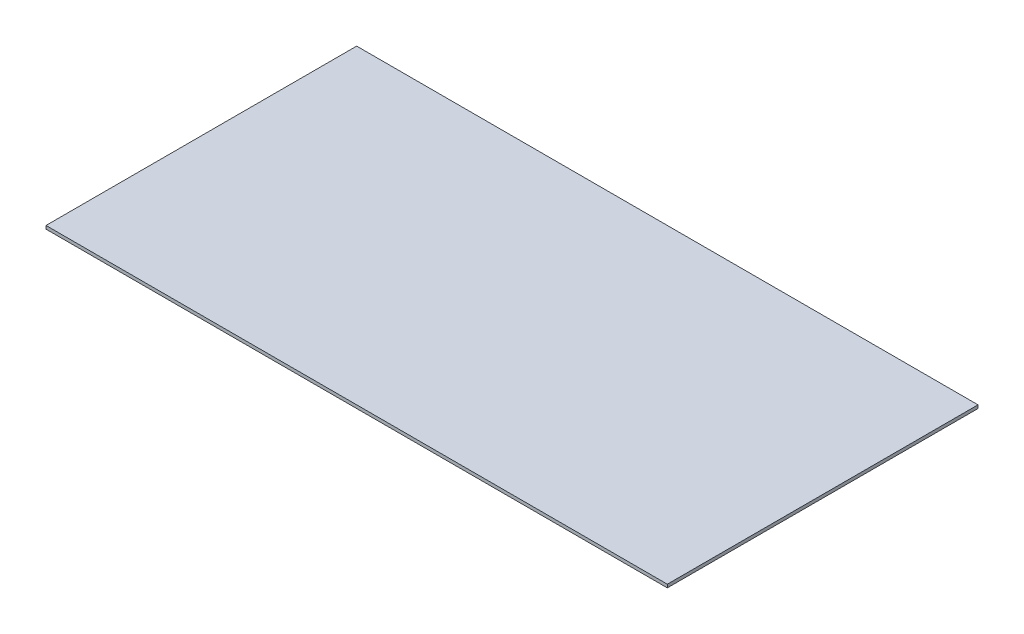
ISO-10303-21;
HEADER;
FILE_DESCRIPTION(('STEP AP214'),'2;1');
FILE_NAME('part.step','',(''),(''),'','','');
FILE_SCHEMA(('AUTOMOTIVE_DESIGN { 1 0 10303 214 1 1 1 1 }'));
ENDSEC;
DATA;
#1=APPLICATION_CONTEXT('core data for automotive mechanical design processes');
#2=APPLICATION_PROTOCOL_DEFINITION('international standard','automotive_design',2000,#1);
#3=PRODUCT_CONTEXT('',#1,'mechanical');
#4=PRODUCT('Part','Part','',(#3));
#5=PRODUCT_RELATED_PRODUCT_CATEGORY('part','',(#4));
#6=PRODUCT_DEFINITION_FORMATION('','',#4);
#7=PRODUCT_DEFINITION_CONTEXT('part definition',#1,'design');
#8=PRODUCT_DEFINITION('design','',#6,#7);
#9=PRODUCT_DEFINITION_SHAPE('','',#8);
#10=(LENGTH_UNIT() NAMED_UNIT(*) SI_UNIT(.MILLI.,.METRE.));
#11=(NAMED_UNIT(*) PLANE_ANGLE_UNIT() SI_UNIT($,.RADIAN.));
#12=(NAMED_UNIT(*) SI_UNIT($,.STERADIAN.) SOLID_ANGLE_UNIT());
#13=UNCERTAINTY_MEASURE_WITH_UNIT(LENGTH_MEASURE(1.E-05),#10,'distance_accuracy_value','');
#14=(GEOMETRIC_REPRESENTATION_CONTEXT(3) GLOBAL_UNCERTAINTY_ASSIGNED_CONTEXT((#13)) GLOBAL_UNIT_ASSIGNED_CONTEXT((#10,
#11,#12)) REPRESENTATION_CONTEXT('',''));
#15=CARTESIAN_POINT('',(0.,0.,0.));
#16=DIRECTION('',(0.,0.,1.));
#17=DIRECTION('',(1.,0.,0.));
#18=AXIS2_PLACEMENT_3D('',#15,#16,#17);
#19=CARTESIAN_POINT('',(0.,12.7,0.));
#20=DIRECTION('',(1.,0.,0.));
#21=DIRECTION('',(0.,0.,-1.));
#22=AXIS2_PLACEMENT_3D('',#19,#20,#21);
#23=PLANE('',#22);
#24=DIRECTION('',(0.,0.,1.));
#25=VECTOR('',#24,1.);
#26=CARTESIAN_POINT('',(0.,0.,0.));
#27=LINE('',#26,#25);
#28=CARTESIAN_POINT('',(0.,0.,-1219.2));
#29=VERTEX_POINT('',#28);
#30=CARTESIAN_POINT('',(0.,0.,0.));
#31=VERTEX_POINT('',#30);
#32=EDGE_CURVE('E111',#29,#31,#27,.T.);
#33=ORIENTED_EDGE('',*,*,#32,.T.);
#34=DIRECTION('',(0.,-1.,0.));
#35=VECTOR('',#34,1.);
#36=CARTESIAN_POINT('',(0.,12.7,0.));
#37=LINE('',#36,#35);
#38=CARTESIAN_POINT('',(0.,12.7,0.));
#39=VERTEX_POINT('',#38);
#40=EDGE_CURVE('E11',#39,#31,#37,.T.);
#41=ORIENTED_EDGE('',*,*,#40,.F.);
#42=DIRECTION('',(0.,0.,1.));
#43=VECTOR('',#42,1.);
#44=CARTESIAN_POINT('',(0.,12.7,0.));
#45=LINE('',#44,#43);
#46=CARTESIAN_POINT('',(0.,12.7,-1219.2));
#47=VERTEX_POINT('',#46);
#48=EDGE_CURVE('E95',#47,#39,#45,.T.);
#49=ORIENTED_EDGE('',*,*,#48,.F.);
#50=DIRECTION('',(0.,-1.,0.));
#51=VECTOR('',#50,1.);
#52=CARTESIAN_POINT('',(0.,12.7,-1219.2));
#53=LINE('',#52,#51);
#54=EDGE_CURVE('E107',#47,#29,#53,.T.);
#55=ORIENTED_EDGE('',*,*,#54,.T.);
#56=EDGE_LOOP('',(#33,#41,#49,#55));
#57=FACE_BOUND('',#56,.T.);
#58=ADVANCED_FACE('F43',(#57),#23,.F.);
#59=CARTESIAN_POINT('',(0.,12.7,0.));
#60=DIRECTION('',(0.,0.,-1.));
#61=DIRECTION('',(-1.,0.,0.));
#62=AXIS2_PLACEMENT_3D('',#59,#60,#61);
#63=PLANE('',#62);
#64=DIRECTION('',(1.,0.,0.));
#65=VECTOR('',#64,1.);
#66=CARTESIAN_POINT('',(0.,0.,0.));
#67=LINE('',#66,#65);
#68=CARTESIAN_POINT('',(2438.4,0.,0.));
#69=VERTEX_POINT('',#68);
#70=EDGE_CURVE('E100',#31,#69,#67,.T.);
#71=ORIENTED_EDGE('',*,*,#70,.T.);
#72=DIRECTION('',(0.,-1.,0.));
#73=VECTOR('',#72,1.);
#74=CARTESIAN_POINT('',(2438.4,12.7,0.));
#75=LINE('',#74,#73);
#76=CARTESIAN_POINT('',(2438.4,12.7,0.));
#77=VERTEX_POINT('',#76);
#78=EDGE_CURVE('E52',#77,#69,#75,.T.);
#79=ORIENTED_EDGE('',*,*,#78,.F.);
#80=DIRECTION('',(1.,0.,0.));
#81=VECTOR('',#80,1.);
#82=CARTESIAN_POINT('',(0.,12.7,0.));
#83=LINE('',#82,#81);
#84=EDGE_CURVE('E90',#39,#77,#83,.T.);
#85=ORIENTED_EDGE('',*,*,#84,.F.);
#86=ORIENTED_EDGE('',*,*,#40,.T.);
#87=EDGE_LOOP('',(#71,#79,#85,#86));
#88=FACE_BOUND('',#87,.T.);
#89=ADVANCED_FACE('F99',(#88),#63,.F.);
#90=CARTESIAN_POINT('',(2438.4,12.7,0.));
#91=DIRECTION('',(-1.,0.,0.));
#92=DIRECTION('',(0.,0.,1.));
#93=AXIS2_PLACEMENT_3D('',#90,#91,#92);
#94=PLANE('',#93);
#95=DIRECTION('',(0.,0.,-1.));
#96=VECTOR('',#95,1.);
#97=CARTESIAN_POINT('',(2438.4,0.,0.));
#98=LINE('',#97,#96);
#99=CARTESIAN_POINT('',(2438.4,0.,-1219.2));
#100=VERTEX_POINT('',#99);
#101=EDGE_CURVE('E77',#69,#100,#98,.T.);
#102=ORIENTED_EDGE('',*,*,#101,.T.);
#103=DIRECTION('',(0.,-1.,0.));
#104=VECTOR('',#103,1.);
#105=CARTESIAN_POINT('',(2438.4,12.7,-1219.2));
#106=LINE('',#105,#104);
#107=CARTESIAN_POINT('',(2438.4,12.7,-1219.2));
#108=VERTEX_POINT('',#107);
#109=EDGE_CURVE('E102',#108,#100,#106,.T.);
#110=ORIENTED_EDGE('',*,*,#109,.F.);
#111=DIRECTION('',(0.,0.,-1.));
#112=VECTOR('',#111,1.);
#113=CARTESIAN_POINT('',(2438.4,12.7,0.));
#114=LINE('',#113,#112);
#115=EDGE_CURVE('E93',#77,#108,#114,.T.);
#116=ORIENTED_EDGE('',*,*,#115,.F.);
#117=ORIENTED_EDGE('',*,*,#78,.T.);
#118=EDGE_LOOP('',(#102,#110,#116,#117));
#119=FACE_BOUND('',#118,.T.);
#120=ADVANCED_FACE('F103',(#119),#94,.F.);
#121=CARTESIAN_POINT('',(0.,12.7,-1219.2));
#122=DIRECTION('',(0.,0.,1.));
#123=DIRECTION('',(1.,0.,0.));
#124=AXIS2_PLACEMENT_3D('',#121,#122,#123);
#125=PLANE('',#124);
#126=DIRECTION('',(-1.,0.,0.));
#127=VECTOR('',#126,1.);
#128=CARTESIAN_POINT('',(0.,0.,-1219.2));
#129=LINE('',#128,#127);
#130=EDGE_CURVE('E83',#100,#29,#129,.T.);
#131=ORIENTED_EDGE('',*,*,#130,.T.);
#132=ORIENTED_EDGE('',*,*,#54,.F.);
#133=DIRECTION('',(-1.,0.,0.));
#134=VECTOR('',#133,1.);
#135=CARTESIAN_POINT('',(0.,12.7,-1219.2));
#136=LINE('',#135,#134);
#137=EDGE_CURVE('E60',#108,#47,#136,.T.);
#138=ORIENTED_EDGE('',*,*,#137,.F.);
#139=ORIENTED_EDGE('',*,*,#109,.T.);
#140=EDGE_LOOP('',(#131,#132,#138,#139));
#141=FACE_BOUND('',#140,.T.);
#142=ADVANCED_FACE('F124',(#141),#125,.F.);
#143=CARTESIAN_POINT('',(0.,12.7,0.));
#144=DIRECTION('',(0.,-1.,0.));
#145=DIRECTION('',(0.,0.,-1.));
#146=AXIS2_PLACEMENT_3D('',#143,#144,#145);
#147=PLANE('',#146);
#148=ORIENTED_EDGE('',*,*,#48,.T.);
#149=ORIENTED_EDGE('',*,*,#84,.T.);
#150=ORIENTED_EDGE('',*,*,#115,.T.);
#151=ORIENTED_EDGE('',*,*,#137,.T.);
#152=EDGE_LOOP('',(#148,#149,#150,#151));
#153=FACE_BOUND('',#152,.T.);
#154=ADVANCED_FACE('F91',(#153),#147,.F.);
#155=CARTESIAN_POINT('',(0.,0.,0.));
#156=DIRECTION('',(0.,-1.,0.));
#157=DIRECTION('',(0.,0.,-1.));
#158=AXIS2_PLACEMENT_3D('',#155,#156,#157);
#159=PLANE('',#158);
#160=ORIENTED_EDGE('',*,*,#32,.F.);
#161=ORIENTED_EDGE('',*,*,#130,.F.);
#162=ORIENTED_EDGE('',*,*,#101,.F.);
#163=ORIENTED_EDGE('',*,*,#70,.F.);
#164=EDGE_LOOP('',(#160,#161,#162,#163));
#165=FACE_BOUND('',#164,.T.);
#166=ADVANCED_FACE('F127',(#165),#159,.T.);
#167=CLOSED_SHELL('',(#58,#89,#120,#142,#154,#166));
#168=MANIFOLD_SOLID_BREP('B2',#167);
#169=ADVANCED_BREP_SHAPE_REPRESENTATION('',(#18,#168),#14);
#170=SHAPE_DEFINITION_REPRESENTATION(#9,#169);
ENDSEC;
END-ISO-10303-21;
